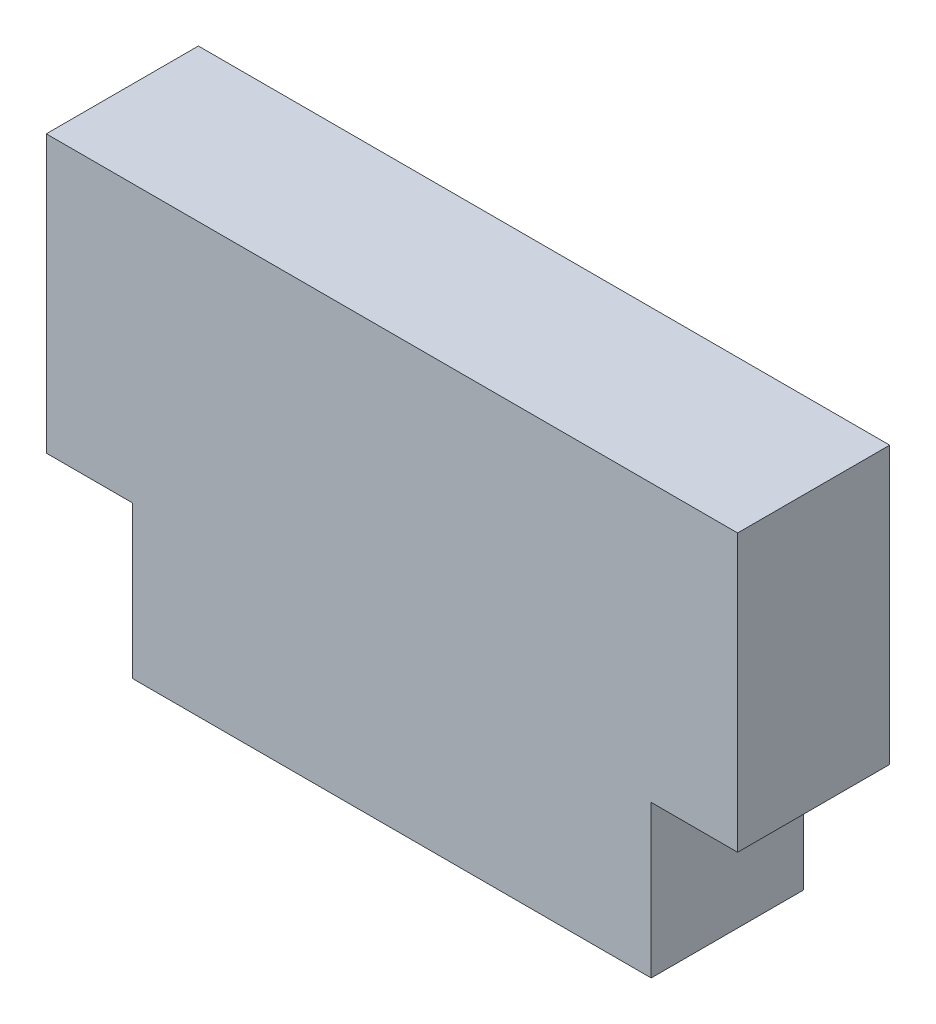
ISO-10303-21;
HEADER;
FILE_DESCRIPTION(('STEP AP214'),'2;1');
FILE_NAME('part.step','',(''),(''),'','','');
FILE_SCHEMA(('AUTOMOTIVE_DESIGN { 1 0 10303 214 1 1 1 1 }'));
ENDSEC;
DATA;
#1=APPLICATION_CONTEXT('core data for automotive mechanical design processes');
#2=APPLICATION_PROTOCOL_DEFINITION('international standard','automotive_design',2000,#1);
#3=PRODUCT_CONTEXT('',#1,'mechanical');
#4=PRODUCT('Part','Part','',(#3));
#5=PRODUCT_RELATED_PRODUCT_CATEGORY('part','',(#4));
#6=PRODUCT_DEFINITION_FORMATION('','',#4);
#7=PRODUCT_DEFINITION_CONTEXT('part definition',#1,'design');
#8=PRODUCT_DEFINITION('design','',#6,#7);
#9=PRODUCT_DEFINITION_SHAPE('','',#8);
#10=(LENGTH_UNIT() NAMED_UNIT(*) SI_UNIT(.MILLI.,.METRE.));
#11=(NAMED_UNIT(*) PLANE_ANGLE_UNIT() SI_UNIT($,.RADIAN.));
#12=(NAMED_UNIT(*) SI_UNIT($,.STERADIAN.) SOLID_ANGLE_UNIT());
#13=UNCERTAINTY_MEASURE_WITH_UNIT(LENGTH_MEASURE(1.E-05),#10,'distance_accuracy_value','');
#14=(GEOMETRIC_REPRESENTATION_CONTEXT(3) GLOBAL_UNCERTAINTY_ASSIGNED_CONTEXT((#13)) GLOBAL_UNIT_ASSIGNED_CONTEXT((#10,
#11,#12)) REPRESENTATION_CONTEXT('',''));
#15=CARTESIAN_POINT('',(0.,0.,0.));
#16=DIRECTION('',(0.,0.,1.));
#17=DIRECTION('',(1.,0.,0.));
#18=AXIS2_PLACEMENT_3D('',#15,#16,#17);
#19=CARTESIAN_POINT('',(12.7,-5.08,5.588));
#20=DIRECTION('',(-1.,0.,0.));
#21=DIRECTION('',(0.,-1.,0.));
#22=AXIS2_PLACEMENT_3D('',#19,#20,#21);
#23=PLANE('',#22);
#24=DIRECTION('',(0.,1.,0.));
#25=VECTOR('',#24,1.);
#26=CARTESIAN_POINT('',(12.7,-5.08,0.));
#27=LINE('',#26,#25);
#28=CARTESIAN_POINT('',(12.7,-5.08,0.));
#29=VERTEX_POINT('',#28);
#30=CARTESIAN_POINT('',(12.7,5.08,0.));
#31=VERTEX_POINT('',#30);
#32=EDGE_CURVE('E128',#29,#31,#27,.T.);
#33=ORIENTED_EDGE('',*,*,#32,.T.);
#34=DIRECTION('',(0.,0.,-1.));
#35=VECTOR('',#34,1.);
#36=CARTESIAN_POINT('',(12.7,5.08,5.588));
#37=LINE('',#36,#35);
#38=CARTESIAN_POINT('',(12.7,5.08,5.588));
#39=VERTEX_POINT('',#38);
#40=EDGE_CURVE('E11',#39,#31,#37,.T.);
#41=ORIENTED_EDGE('',*,*,#40,.F.);
#42=DIRECTION('',(0.,1.,0.));
#43=VECTOR('',#42,1.);
#44=CARTESIAN_POINT('',(12.7,-5.08,5.588));
#45=LINE('',#44,#43);
#46=CARTESIAN_POINT('',(12.7,-5.08,5.588));
#47=VERTEX_POINT('',#46);
#48=EDGE_CURVE('E142',#47,#39,#45,.T.);
#49=ORIENTED_EDGE('',*,*,#48,.F.);
#50=DIRECTION('',(0.,0.,-1.));
#51=VECTOR('',#50,1.);
#52=CARTESIAN_POINT('',(12.7,-5.08,5.588));
#53=LINE('',#52,#51);
#54=EDGE_CURVE('E124',#47,#29,#53,.T.);
#55=ORIENTED_EDGE('',*,*,#54,.T.);
#56=EDGE_LOOP('',(#33,#41,#49,#55));
#57=FACE_BOUND('',#56,.T.);
#58=ADVANCED_FACE('F32',(#57),#23,.F.);
#59=CARTESIAN_POINT('',(-12.7,5.08,5.588));
#60=DIRECTION('',(0.,-1.,0.));
#61=DIRECTION('',(1.,0.,0.));
#62=AXIS2_PLACEMENT_3D('',#59,#60,#61);
#63=PLANE('',#62);
#64=DIRECTION('',(-1.,0.,0.));
#65=VECTOR('',#64,1.);
#66=CARTESIAN_POINT('',(-12.7,5.08,0.));
#67=LINE('',#66,#65);
#68=CARTESIAN_POINT('',(-12.7,5.08,0.));
#69=VERTEX_POINT('',#68);
#70=EDGE_CURVE('E131',#31,#69,#67,.T.);
#71=ORIENTED_EDGE('',*,*,#70,.T.);
#72=DIRECTION('',(0.,0.,-1.));
#73=VECTOR('',#72,1.);
#74=CARTESIAN_POINT('',(-12.7,5.08,5.588));
#75=LINE('',#74,#73);
#76=CARTESIAN_POINT('',(-12.7,5.08,5.588));
#77=VERTEX_POINT('',#76);
#78=EDGE_CURVE('E40',#77,#69,#75,.T.);
#79=ORIENTED_EDGE('',*,*,#78,.F.);
#80=DIRECTION('',(-1.,0.,0.));
#81=VECTOR('',#80,1.);
#82=CARTESIAN_POINT('',(-12.7,5.08,5.588));
#83=LINE('',#82,#81);
#84=EDGE_CURVE('E91',#39,#77,#83,.T.);
#85=ORIENTED_EDGE('',*,*,#84,.F.);
#86=ORIENTED_EDGE('',*,*,#40,.T.);
#87=EDGE_LOOP('',(#71,#79,#85,#86));
#88=FACE_BOUND('',#87,.T.);
#89=ADVANCED_FACE('F177',(#88),#63,.F.);
#90=CARTESIAN_POINT('',(-12.7,-5.08,5.588));
#91=DIRECTION('',(1.,0.,0.));
#92=DIRECTION('',(0.,0.,-1.));
#93=AXIS2_PLACEMENT_3D('',#90,#91,#92);
#94=PLANE('',#93);
#95=DIRECTION('',(0.,-1.,0.));
#96=VECTOR('',#95,1.);
#97=CARTESIAN_POINT('',(-12.7,-5.08,0.));
#98=LINE('',#97,#96);
#99=CARTESIAN_POINT('',(-12.7,-5.08,0.));
#100=VERTEX_POINT('',#99);
#101=EDGE_CURVE('E133',#69,#100,#98,.T.);
#102=ORIENTED_EDGE('',*,*,#101,.T.);
#103=DIRECTION('',(0.,0.,-1.));
#104=VECTOR('',#103,1.);
#105=CARTESIAN_POINT('',(-12.7,-5.08,5.588));
#106=LINE('',#105,#104);
#107=CARTESIAN_POINT('',(-12.7,-5.08,5.588));
#108=VERTEX_POINT('',#107);
#109=EDGE_CURVE('E149',#108,#100,#106,.T.);
#110=ORIENTED_EDGE('',*,*,#109,.F.);
#111=DIRECTION('',(0.,-1.,0.));
#112=VECTOR('',#111,1.);
#113=CARTESIAN_POINT('',(-12.7,-5.08,5.588));
#114=LINE('',#113,#112);
#115=EDGE_CURVE('E157',#77,#108,#114,.T.);
#116=ORIENTED_EDGE('',*,*,#115,.F.);
#117=ORIENTED_EDGE('',*,*,#78,.T.);
#118=EDGE_LOOP('',(#102,#110,#116,#117));
#119=FACE_BOUND('',#118,.T.);
#120=ADVANCED_FACE('F155',(#119),#94,.F.);
#121=CARTESIAN_POINT('',(-12.7,-5.08,5.588));
#122=DIRECTION('',(0.,1.,0.));
#123=DIRECTION('',(0.,0.,1.));
#124=AXIS2_PLACEMENT_3D('',#121,#122,#123);
#125=PLANE('',#124);
#126=DIRECTION('',(1.,0.,0.));
#127=VECTOR('',#126,1.);
#128=CARTESIAN_POINT('',(-12.7,-5.08,0.));
#129=LINE('',#128,#127);
#130=CARTESIAN_POINT('',(-9.525,-5.08,0.));
#131=VERTEX_POINT('',#130);
#132=EDGE_CURVE('E135',#100,#131,#129,.T.);
#133=ORIENTED_EDGE('',*,*,#132,.T.);
#134=DIRECTION('',(0.,0.,-1.));
#135=VECTOR('',#134,1.);
#136=CARTESIAN_POINT('',(-9.525,-5.08,5.588));
#137=LINE('',#136,#135);
#138=CARTESIAN_POINT('',(-9.525,-5.08,5.588));
#139=VERTEX_POINT('',#138);
#140=EDGE_CURVE('E146',#139,#131,#137,.T.);
#141=ORIENTED_EDGE('',*,*,#140,.F.);
#142=DIRECTION('',(1.,0.,0.));
#143=VECTOR('',#142,1.);
#144=CARTESIAN_POINT('',(-12.7,-5.08,5.588));
#145=LINE('',#144,#143);
#146=EDGE_CURVE('E169',#108,#139,#145,.T.);
#147=ORIENTED_EDGE('',*,*,#146,.F.);
#148=ORIENTED_EDGE('',*,*,#109,.T.);
#149=EDGE_LOOP('',(#133,#141,#147,#148));
#150=FACE_BOUND('',#149,.T.);
#151=ADVANCED_FACE('F165',(#150),#125,.F.);
#152=CARTESIAN_POINT('',(-9.525,-5.08,5.588));
#153=DIRECTION('',(1.,0.,0.));
#154=DIRECTION('',(0.,0.,-1.));
#155=AXIS2_PLACEMENT_3D('',#152,#153,#154);
#156=PLANE('',#155);
#157=DIRECTION('',(0.,-1.,0.));
#158=VECTOR('',#157,1.);
#159=CARTESIAN_POINT('',(-9.525,-5.08,0.));
#160=LINE('',#159,#158);
#161=CARTESIAN_POINT('',(-9.525,-10.668,0.));
#162=VERTEX_POINT('',#161);
#163=EDGE_CURVE('E137',#131,#162,#160,.T.);
#164=ORIENTED_EDGE('',*,*,#163,.T.);
#165=DIRECTION('',(0.,0.,-1.));
#166=VECTOR('',#165,1.);
#167=CARTESIAN_POINT('',(-9.525,-10.668,5.588));
#168=LINE('',#167,#166);
#169=CARTESIAN_POINT('',(-9.525,-10.668,5.588));
#170=VERTEX_POINT('',#169);
#171=EDGE_CURVE('E119',#170,#162,#168,.T.);
#172=ORIENTED_EDGE('',*,*,#171,.F.);
#173=DIRECTION('',(0.,-1.,0.));
#174=VECTOR('',#173,1.);
#175=CARTESIAN_POINT('',(-9.525,-5.08,5.588));
#176=LINE('',#175,#174);
#177=EDGE_CURVE('E110',#139,#170,#176,.T.);
#178=ORIENTED_EDGE('',*,*,#177,.F.);
#179=ORIENTED_EDGE('',*,*,#140,.T.);
#180=EDGE_LOOP('',(#164,#172,#178,#179));
#181=FACE_BOUND('',#180,.T.);
#182=ADVANCED_FACE('F168',(#181),#156,.F.);
#183=CARTESIAN_POINT('',(-9.525,-10.668,5.588));
#184=DIRECTION('',(0.,1.,0.));
#185=DIRECTION('',(0.,0.,1.));
#186=AXIS2_PLACEMENT_3D('',#183,#184,#185);
#187=PLANE('',#186);
#188=DIRECTION('',(1.,0.,0.));
#189=VECTOR('',#188,1.);
#190=CARTESIAN_POINT('',(-9.525,-10.668,0.));
#191=LINE('',#190,#189);
#192=CARTESIAN_POINT('',(9.52500000000001,-10.668,0.));
#193=VERTEX_POINT('',#192);
#194=EDGE_CURVE('E118',#162,#193,#191,.T.);
#195=ORIENTED_EDGE('',*,*,#194,.T.);
#196=DIRECTION('',(0.,0.,-1.));
#197=VECTOR('',#196,1.);
#198=CARTESIAN_POINT('',(9.52500000000001,-10.668,5.588));
#199=LINE('',#198,#197);
#200=CARTESIAN_POINT('',(9.52500000000001,-10.668,5.588));
#201=VERTEX_POINT('',#200);
#202=EDGE_CURVE('E115',#201,#193,#199,.T.);
#203=ORIENTED_EDGE('',*,*,#202,.F.);
#204=DIRECTION('',(1.,0.,0.));
#205=VECTOR('',#204,1.);
#206=CARTESIAN_POINT('',(-9.525,-10.668,5.588));
#207=LINE('',#206,#205);
#208=EDGE_CURVE('E104',#170,#201,#207,.T.);
#209=ORIENTED_EDGE('',*,*,#208,.F.);
#210=ORIENTED_EDGE('',*,*,#171,.T.);
#211=EDGE_LOOP('',(#195,#203,#209,#210));
#212=FACE_BOUND('',#211,.T.);
#213=ADVANCED_FACE('F116',(#212),#187,.F.);
#214=CARTESIAN_POINT('',(9.52500000000001,-5.08,5.588));
#215=DIRECTION('',(-1.,0.,0.));
#216=DIRECTION('',(0.,0.,1.));
#217=AXIS2_PLACEMENT_3D('',#214,#215,#216);
#218=PLANE('',#217);
#219=DIRECTION('',(0.,1.,0.));
#220=VECTOR('',#219,1.);
#221=CARTESIAN_POINT('',(9.52500000000001,-5.08,0.));
#222=LINE('',#221,#220);
#223=CARTESIAN_POINT('',(9.52500000000001,-5.08,0.));
#224=VERTEX_POINT('',#223);
#225=EDGE_CURVE('E77',#193,#224,#222,.T.);
#226=ORIENTED_EDGE('',*,*,#225,.T.);
#227=DIRECTION('',(0.,0.,-1.));
#228=VECTOR('',#227,1.);
#229=CARTESIAN_POINT('',(9.52500000000001,-5.08,5.588));
#230=LINE('',#229,#228);
#231=CARTESIAN_POINT('',(9.52500000000001,-5.08,5.588));
#232=VERTEX_POINT('',#231);
#233=EDGE_CURVE('E120',#232,#224,#230,.T.);
#234=ORIENTED_EDGE('',*,*,#233,.F.);
#235=DIRECTION('',(0.,1.,0.));
#236=VECTOR('',#235,1.);
#237=CARTESIAN_POINT('',(9.52500000000001,-5.08,5.588));
#238=LINE('',#237,#236);
#239=EDGE_CURVE('E108',#201,#232,#238,.T.);
#240=ORIENTED_EDGE('',*,*,#239,.F.);
#241=ORIENTED_EDGE('',*,*,#202,.T.);
#242=EDGE_LOOP('',(#226,#234,#240,#241));
#243=FACE_BOUND('',#242,.T.);
#244=ADVANCED_FACE('F122',(#243),#218,.F.);
#245=CARTESIAN_POINT('',(9.52500000000001,-5.08,5.588));
#246=DIRECTION('',(0.,1.,0.));
#247=DIRECTION('',(0.,0.,1.));
#248=AXIS2_PLACEMENT_3D('',#245,#246,#247);
#249=PLANE('',#248);
#250=DIRECTION('',(1.,0.,0.));
#251=VECTOR('',#250,1.);
#252=CARTESIAN_POINT('',(9.52500000000001,-5.08,0.));
#253=LINE('',#252,#251);
#254=EDGE_CURVE('E83',#224,#29,#253,.T.);
#255=ORIENTED_EDGE('',*,*,#254,.T.);
#256=ORIENTED_EDGE('',*,*,#54,.F.);
#257=DIRECTION('',(1.,0.,0.));
#258=VECTOR('',#257,1.);
#259=CARTESIAN_POINT('',(9.52500000000001,-5.08,5.588));
#260=LINE('',#259,#258);
#261=EDGE_CURVE('E48',#232,#47,#260,.T.);
#262=ORIENTED_EDGE('',*,*,#261,.F.);
#263=ORIENTED_EDGE('',*,*,#233,.T.);
#264=EDGE_LOOP('',(#255,#256,#262,#263));
#265=FACE_BOUND('',#264,.T.);
#266=ADVANCED_FACE('F193',(#265),#249,.F.);
#267=CARTESIAN_POINT('',(0.,0.,5.588));
#268=DIRECTION('',(0.,0.,-1.));
#269=DIRECTION('',(-1.,0.,0.));
#270=AXIS2_PLACEMENT_3D('',#267,#268,#269);
#271=PLANE('',#270);
#272=ORIENTED_EDGE('',*,*,#48,.T.);
#273=ORIENTED_EDGE('',*,*,#84,.T.);
#274=ORIENTED_EDGE('',*,*,#115,.T.);
#275=ORIENTED_EDGE('',*,*,#146,.T.);
#276=ORIENTED_EDGE('',*,*,#177,.T.);
#277=ORIENTED_EDGE('',*,*,#208,.T.);
#278=ORIENTED_EDGE('',*,*,#239,.T.);
#279=ORIENTED_EDGE('',*,*,#261,.T.);
#280=EDGE_LOOP('',(#272,#273,#274,#275,#276,#277,#278,#279));
#281=FACE_BOUND('',#280,.T.);
#282=ADVANCED_FACE('F106',(#281),#271,.F.);
#283=CARTESIAN_POINT('',(0.,0.,0.));
#284=DIRECTION('',(0.,0.,-1.));
#285=DIRECTION('',(-1.,0.,0.));
#286=AXIS2_PLACEMENT_3D('',#283,#284,#285);
#287=PLANE('',#286);
#288=ORIENTED_EDGE('',*,*,#32,.F.);
#289=ORIENTED_EDGE('',*,*,#254,.F.);
#290=ORIENTED_EDGE('',*,*,#225,.F.);
#291=ORIENTED_EDGE('',*,*,#194,.F.);
#292=ORIENTED_EDGE('',*,*,#163,.F.);
#293=ORIENTED_EDGE('',*,*,#132,.F.);
#294=ORIENTED_EDGE('',*,*,#101,.F.);
#295=ORIENTED_EDGE('',*,*,#70,.F.);
#296=EDGE_LOOP('',(#288,#289,#290,#291,#292,#293,#294,#295));
#297=FACE_BOUND('',#296,.T.);
#298=ADVANCED_FACE('F161',(#297),#287,.T.);
#299=CLOSED_SHELL('',(#58,#89,#120,#151,#182,#213,#244,#266,#282,#298));
#300=MANIFOLD_SOLID_BREP('B2',#299);
#301=ADVANCED_BREP_SHAPE_REPRESENTATION('',(#18,#300),#14);
#302=SHAPE_DEFINITION_REPRESENTATION(#9,#301);
ENDSEC;
END-ISO-10303-21;
